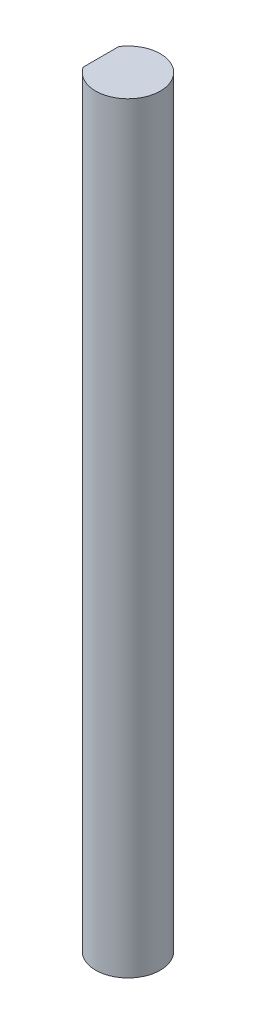
ISO-10303-21;
HEADER;
FILE_DESCRIPTION(('STEP AP214'),'2;1');
FILE_NAME('part.step','',(''),(''),'','','');
FILE_SCHEMA(('AUTOMOTIVE_DESIGN { 1 0 10303 214 1 1 1 1 }'));
ENDSEC;
DATA;
#1=APPLICATION_CONTEXT('core data for automotive mechanical design processes');
#2=APPLICATION_PROTOCOL_DEFINITION('international standard','automotive_design',2000,#1);
#3=PRODUCT_CONTEXT('',#1,'mechanical');
#4=PRODUCT('Part','Part','',(#3));
#5=PRODUCT_RELATED_PRODUCT_CATEGORY('part','',(#4));
#6=PRODUCT_DEFINITION_FORMATION('','',#4);
#7=PRODUCT_DEFINITION_CONTEXT('part definition',#1,'design');
#8=PRODUCT_DEFINITION('design','',#6,#7);
#9=PRODUCT_DEFINITION_SHAPE('','',#8);
#10=(LENGTH_UNIT() NAMED_UNIT(*) SI_UNIT(.MILLI.,.METRE.));
#11=(NAMED_UNIT(*) PLANE_ANGLE_UNIT() SI_UNIT($,.RADIAN.));
#12=(NAMED_UNIT(*) SI_UNIT($,.STERADIAN.) SOLID_ANGLE_UNIT());
#13=UNCERTAINTY_MEASURE_WITH_UNIT(LENGTH_MEASURE(1.E-05),#10,'distance_accuracy_value','');
#14=(GEOMETRIC_REPRESENTATION_CONTEXT(3) GLOBAL_UNCERTAINTY_ASSIGNED_CONTEXT((#13)) GLOBAL_UNIT_ASSIGNED_CONTEXT((#10,
#11,#12)) REPRESENTATION_CONTEXT('',''));
#15=CARTESIAN_POINT('',(0.,0.,0.));
#16=DIRECTION('',(0.,0.,1.));
#17=DIRECTION('',(1.,0.,0.));
#18=AXIS2_PLACEMENT_3D('',#15,#16,#17);
#19=CARTESIAN_POINT('',(0.,35.3,0.));
#20=DIRECTION('',(0.,-1.,0.));
#21=DIRECTION('',(0.,0.,-1.));
#22=AXIS2_PLACEMENT_3D('',#19,#20,#21);
#23=CYLINDRICAL_SURFACE('',#22,1.5);
#24=CARTESIAN_POINT('',(0.,0.,0.));
#25=DIRECTION('',(0.,1.,0.));
#26=DIRECTION('',(0.,0.,1.));
#27=AXIS2_PLACEMENT_3D('',#24,#25,#26);
#28=CIRCLE('',#27,1.5);
#29=CARTESIAN_POINT('',(-1.25,0.,0.82915619758885));
#30=VERTEX_POINT('',#29);
#31=CARTESIAN_POINT('',(-1.25,0.,-0.82915619758885));
#32=VERTEX_POINT('',#31);
#33=EDGE_CURVE('E64',#30,#32,#28,.T.);
#34=ORIENTED_EDGE('',*,*,#33,.T.);
#35=DIRECTION('',(0.,-1.,0.));
#36=VECTOR('',#35,1.);
#37=CARTESIAN_POINT('',(-1.25,35.3,-0.82915619758885));
#38=LINE('',#37,#36);
#39=CARTESIAN_POINT('',(-1.25,35.3,-0.82915619758885));
#40=VERTEX_POINT('',#39);
#41=EDGE_CURVE('E11',#40,#32,#38,.T.);
#42=ORIENTED_EDGE('',*,*,#41,.F.);
#43=CARTESIAN_POINT('',(0.,35.3,0.));
#44=DIRECTION('',(0.,1.,0.));
#45=DIRECTION('',(0.,0.,1.));
#46=AXIS2_PLACEMENT_3D('',#43,#44,#45);
#47=CIRCLE('',#46,1.5);
#48=CARTESIAN_POINT('',(-1.25,35.3,0.82915619758885));
#49=VERTEX_POINT('',#48);
#50=EDGE_CURVE('E63',#49,#40,#47,.T.);
#51=ORIENTED_EDGE('',*,*,#50,.F.);
#52=DIRECTION('',(0.,-1.,0.));
#53=VECTOR('',#52,1.);
#54=CARTESIAN_POINT('',(-1.25,35.3,0.82915619758885));
#55=LINE('',#54,#53);
#56=EDGE_CURVE('E41',#49,#30,#55,.T.);
#57=ORIENTED_EDGE('',*,*,#56,.T.);
#58=EDGE_LOOP('',(#34,#42,#51,#57));
#59=FACE_BOUND('',#58,.T.);
#60=ADVANCED_FACE('F33',(#59),#23,.T.);
#61=CARTESIAN_POINT('',(-1.25,35.3,0.82915619758885));
#62=DIRECTION('',(1.,0.,0.));
#63=DIRECTION('',(0.,0.,-1.));
#64=AXIS2_PLACEMENT_3D('',#61,#62,#63);
#65=PLANE('',#64);
#66=DIRECTION('',(0.,0.,1.));
#67=VECTOR('',#66,1.);
#68=CARTESIAN_POINT('',(-1.25,0.,0.82915619758885));
#69=LINE('',#68,#67);
#70=EDGE_CURVE('E56',#32,#30,#69,.T.);
#71=ORIENTED_EDGE('',*,*,#70,.T.);
#72=ORIENTED_EDGE('',*,*,#56,.F.);
#73=DIRECTION('',(0.,0.,1.));
#74=VECTOR('',#73,1.);
#75=CARTESIAN_POINT('',(-1.25,35.3,0.82915619758885));
#76=LINE('',#75,#74);
#77=EDGE_CURVE('E48',#40,#49,#76,.T.);
#78=ORIENTED_EDGE('',*,*,#77,.F.);
#79=ORIENTED_EDGE('',*,*,#41,.T.);
#80=EDGE_LOOP('',(#71,#72,#78,#79));
#81=FACE_BOUND('',#80,.T.);
#82=ADVANCED_FACE('F59',(#81),#65,.F.);
#83=CARTESIAN_POINT('',(0.,35.3,0.));
#84=DIRECTION('',(0.,1.,0.));
#85=DIRECTION('',(0.,0.,1.));
#86=AXIS2_PLACEMENT_3D('',#83,#84,#85);
#87=PLANE('',#86);
#88=ORIENTED_EDGE('',*,*,#50,.T.);
#89=ORIENTED_EDGE('',*,*,#77,.T.);
#90=EDGE_LOOP('',(#88,#89));
#91=FACE_BOUND('',#90,.T.);
#92=ADVANCED_FACE('F71',(#91),#87,.T.);
#93=CARTESIAN_POINT('',(0.,0.,0.));
#94=DIRECTION('',(0.,1.,0.));
#95=DIRECTION('',(0.,0.,1.));
#96=AXIS2_PLACEMENT_3D('',#93,#94,#95);
#97=PLANE('',#96);
#98=ORIENTED_EDGE('',*,*,#33,.F.);
#99=ORIENTED_EDGE('',*,*,#70,.F.);
#100=EDGE_LOOP('',(#98,#99));
#101=FACE_BOUND('',#100,.T.);
#102=ADVANCED_FACE('F67',(#101),#97,.F.);
#103=CLOSED_SHELL('',(#60,#82,#92,#102));
#104=MANIFOLD_SOLID_BREP('B2',#103);
#105=ADVANCED_BREP_SHAPE_REPRESENTATION('',(#18,#104),#14);
#106=SHAPE_DEFINITION_REPRESENTATION(#9,#105);
ENDSEC;
END-ISO-10303-21;
